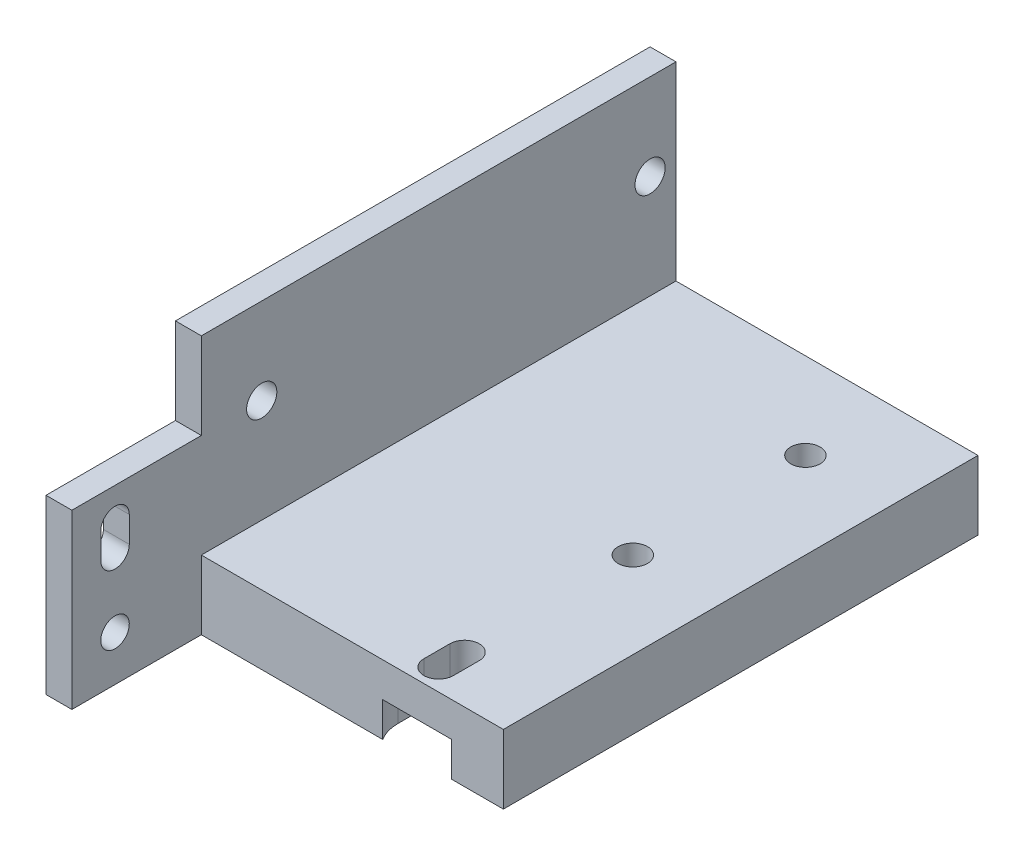
ISO-10303-21;
HEADER;
FILE_DESCRIPTION(('STEP AP214'),'2;1');
FILE_NAME('part.step','',(''),(''),'','','');
FILE_SCHEMA(('AUTOMOTIVE_DESIGN { 1 0 10303 214 1 1 1 1 }'));
ENDSEC;
DATA;
#1=APPLICATION_CONTEXT('core data for automotive mechanical design processes');
#2=APPLICATION_PROTOCOL_DEFINITION('international standard','automotive_design',2000,#1);
#3=PRODUCT_CONTEXT('',#1,'mechanical');
#4=PRODUCT('Part','Part','',(#3));
#5=PRODUCT_RELATED_PRODUCT_CATEGORY('part','',(#4));
#6=PRODUCT_DEFINITION_FORMATION('','',#4);
#7=PRODUCT_DEFINITION_CONTEXT('part definition',#1,'design');
#8=PRODUCT_DEFINITION('design','',#6,#7);
#9=PRODUCT_DEFINITION_SHAPE('','',#8);
#10=(LENGTH_UNIT() NAMED_UNIT(*) SI_UNIT(.MILLI.,.METRE.));
#11=(NAMED_UNIT(*) PLANE_ANGLE_UNIT() SI_UNIT($,.RADIAN.));
#12=(NAMED_UNIT(*) SI_UNIT($,.STERADIAN.) SOLID_ANGLE_UNIT());
#13=UNCERTAINTY_MEASURE_WITH_UNIT(LENGTH_MEASURE(1.E-05),#10,'distance_accuracy_value','');
#14=(GEOMETRIC_REPRESENTATION_CONTEXT(3) GLOBAL_UNCERTAINTY_ASSIGNED_CONTEXT((#13)) GLOBAL_UNIT_ASSIGNED_CONTEXT((#10,
#11,#12)) REPRESENTATION_CONTEXT('',''));
#15=CARTESIAN_POINT('',(0.,0.,0.));
#16=DIRECTION('',(0.,0.,1.));
#17=DIRECTION('',(1.,0.,0.));
#18=AXIS2_PLACEMENT_3D('',#15,#16,#17);
#19=CARTESIAN_POINT('',(0.,0.,55.));
#20=DIRECTION('',(0.,0.,1.));
#21=DIRECTION('',(1.,0.,0.));
#22=AXIS2_PLACEMENT_3D('',#19,#20,#21);
#23=PLANE('',#22);
#24=DIRECTION('',(0.,1.,0.));
#25=VECTOR('',#24,1.);
#26=CARTESIAN_POINT('',(3.,20.,55.));
#27=LINE('',#26,#25);
#28=CARTESIAN_POINT('',(3.,0.,55.));
#29=VERTEX_POINT('',#28);
#30=CARTESIAN_POINT('',(3.,7.99999999999999,55.));
#31=VERTEX_POINT('',#30);
#32=EDGE_CURVE('E50',#29,#31,#27,.T.);
#33=ORIENTED_EDGE('',*,*,#32,.F.);
#34=DIRECTION('',(1.,0.,0.));
#35=VECTOR('',#34,1.);
#36=CARTESIAN_POINT('',(0.,0.,55.));
#37=LINE('',#36,#35);
#38=CARTESIAN_POINT('',(24.0200502515735,0.,55.));
#39=VERTEX_POINT('',#38);
#40=EDGE_CURVE('E377',#29,#39,#37,.T.);
#41=ORIENTED_EDGE('',*,*,#40,.T.);
#42=DIRECTION('',(0.,-1.,0.));
#43=VECTOR('',#42,1.);
#44=CARTESIAN_POINT('',(24.0200502515735,4.,55.));
#45=LINE('',#44,#43);
#46=CARTESIAN_POINT('',(24.0200502515735,4.,55.));
#47=VERTEX_POINT('',#46);
#48=EDGE_CURVE('E11',#47,#39,#45,.T.);
#49=ORIENTED_EDGE('',*,*,#48,.F.);
#50=DIRECTION('',(1.,0.,0.));
#51=VECTOR('',#50,1.);
#52=CARTESIAN_POINT('',(0.,4.,55.));
#53=LINE('',#52,#51);
#54=CARTESIAN_POINT('',(31.9799497484265,4.,55.));
#55=VERTEX_POINT('',#54);
#56=EDGE_CURVE('E320',#47,#55,#53,.T.);
#57=ORIENTED_EDGE('',*,*,#56,.T.);
#58=DIRECTION('',(0.,-1.,0.));
#59=VECTOR('',#58,1.);
#60=CARTESIAN_POINT('',(31.9799497484265,4.,55.));
#61=LINE('',#60,#59);
#62=CARTESIAN_POINT('',(31.9799497484265,0.,55.));
#63=VERTEX_POINT('',#62);
#64=EDGE_CURVE('E42',#63,#55,#61,.F.);
#65=ORIENTED_EDGE('',*,*,#64,.F.);
#66=CARTESIAN_POINT('',(38.,0.,55.));
#67=VERTEX_POINT('',#66);
#68=EDGE_CURVE('E375',#63,#67,#37,.T.);
#69=ORIENTED_EDGE('',*,*,#68,.T.);
#70=DIRECTION('',(0.,1.,0.));
#71=VECTOR('',#70,1.);
#72=CARTESIAN_POINT('',(38.,0.,55.));
#73=LINE('',#72,#71);
#74=CARTESIAN_POINT('',(38.,8.,55.));
#75=VERTEX_POINT('',#74);
#76=EDGE_CURVE('E379',#67,#75,#73,.T.);
#77=ORIENTED_EDGE('',*,*,#76,.T.);
#78=DIRECTION('',(-1.,0.,0.));
#79=VECTOR('',#78,1.);
#80=CARTESIAN_POINT('',(38.,8.,55.));
#81=LINE('',#80,#79);
#82=EDGE_CURVE('E381',#75,#31,#81,.T.);
#83=ORIENTED_EDGE('',*,*,#82,.T.);
#84=EDGE_LOOP('',(#33,#41,#49,#57,#65,#69,#77,#83));
#85=FACE_BOUND('',#84,.T.);
#86=ADVANCED_FACE('F33',(#85),#23,.T.);
#87=CARTESIAN_POINT('',(28.,30.,10.));
#88=DIRECTION('',(0.,-1.,0.));
#89=DIRECTION('',(0.,0.,-1.));
#90=AXIS2_PLACEMENT_3D('',#87,#88,#89);
#91=CYLINDRICAL_SURFACE('',#90,1.7);
#92=CARTESIAN_POINT('',(28.,8.,10.));
#93=DIRECTION('',(0.,-1.,0.));
#94=DIRECTION('',(1.,0.,0.));
#95=AXIS2_PLACEMENT_3D('',#92,#93,#94);
#96=CIRCLE('',#95,1.7);
#97=CARTESIAN_POINT('',(29.7,8.,10.));
#98=VERTEX_POINT('',#97);
#99=EDGE_CURVE('E327',#98,#98,#96,.T.);
#100=ORIENTED_EDGE('',*,*,#99,.F.);
#101=EDGE_LOOP('',(#100));
#102=FACE_BOUND('',#101,.T.);
#103=CARTESIAN_POINT('',(28.,4.,10.));
#104=DIRECTION('',(0.,-1.,0.));
#105=DIRECTION('',(0.,0.,-1.));
#106=AXIS2_PLACEMENT_3D('',#103,#104,#105);
#107=CIRCLE('',#106,1.7);
#108=CARTESIAN_POINT('',(28.,4.,8.3));
#109=VERTEX_POINT('',#108);
#110=EDGE_CURVE('E277',#109,#109,#107,.F.);
#111=ORIENTED_EDGE('',*,*,#110,.F.);
#112=EDGE_LOOP('',(#111));
#113=FACE_BOUND('',#112,.T.);
#114=ADVANCED_FACE('F461',(#102,#113),#91,.F.);
#115=CARTESIAN_POINT('',(28.,30.,52.5));
#116=DIRECTION('',(0.,-1.,0.));
#117=DIRECTION('',(0.,0.,-1.));
#118=AXIS2_PLACEMENT_3D('',#115,#116,#117);
#119=CYLINDRICAL_SURFACE('',#118,1.70000000000001);
#120=CARTESIAN_POINT('',(28.,4.,52.5));
#121=DIRECTION('',(0.,-1.,0.));
#122=DIRECTION('',(0.,0.,-1.));
#123=AXIS2_PLACEMENT_3D('',#120,#121,#122);
#124=CIRCLE('',#123,1.70000000000001);
#125=CARTESIAN_POINT('',(26.3,4.,52.5));
#126=VERTEX_POINT('',#125);
#127=CARTESIAN_POINT('',(29.7,4.,52.5));
#128=VERTEX_POINT('',#127);
#129=EDGE_CURVE('E318',#126,#128,#124,.F.);
#130=ORIENTED_EDGE('',*,*,#129,.F.);
#131=DIRECTION('',(0.,-1.,0.));
#132=VECTOR('',#131,1.);
#133=CARTESIAN_POINT('',(26.3,30.,52.5));
#134=LINE('',#133,#132);
#135=CARTESIAN_POINT('',(26.3,7.99999999999999,52.5));
#136=VERTEX_POINT('',#135);
#137=EDGE_CURVE('E323',#136,#126,#134,.T.);
#138=ORIENTED_EDGE('',*,*,#137,.F.);
#139=CARTESIAN_POINT('',(28.,8.,52.5));
#140=DIRECTION('',(0.,-1.,0.));
#141=DIRECTION('',(1.,0.,0.));
#142=AXIS2_PLACEMENT_3D('',#139,#140,#141);
#143=CIRCLE('',#142,1.70000000000001);
#144=CARTESIAN_POINT('',(29.7,8.,52.5));
#145=VERTEX_POINT('',#144);
#146=EDGE_CURVE('E427',#145,#136,#143,.T.);
#147=ORIENTED_EDGE('',*,*,#146,.F.);
#148=DIRECTION('',(0.,-1.,0.));
#149=VECTOR('',#148,1.);
#150=CARTESIAN_POINT('',(29.7,30.,52.5));
#151=LINE('',#150,#149);
#152=EDGE_CURVE('E324',#145,#128,#151,.T.);
#153=ORIENTED_EDGE('',*,*,#152,.T.);
#154=EDGE_LOOP('',(#130,#138,#147,#153));
#155=FACE_BOUND('',#154,.T.);
#156=ADVANCED_FACE('F467',(#155),#119,.F.);
#157=CARTESIAN_POINT('',(29.7,30.,52.5));
#158=DIRECTION('',(1.,0.,0.));
#159=DIRECTION('',(0.,0.,-1.));
#160=AXIS2_PLACEMENT_3D('',#157,#158,#159);
#161=PLANE('',#160);
#162=DIRECTION('',(0.,0.,-1.));
#163=VECTOR('',#162,1.);
#164=CARTESIAN_POINT('',(29.7,4.,52.5));
#165=LINE('',#164,#163);
#166=CARTESIAN_POINT('',(29.7,4.,49.5));
#167=VERTEX_POINT('',#166);
#168=EDGE_CURVE('E316',#128,#167,#165,.T.);
#169=ORIENTED_EDGE('',*,*,#168,.F.);
#170=ORIENTED_EDGE('',*,*,#152,.F.);
#171=DIRECTION('',(0.,0.,1.));
#172=VECTOR('',#171,1.);
#173=CARTESIAN_POINT('',(29.7,8.,55.));
#174=LINE('',#173,#172);
#175=CARTESIAN_POINT('',(29.7,8.,49.5));
#176=VERTEX_POINT('',#175);
#177=EDGE_CURVE('E424',#176,#145,#174,.T.);
#178=ORIENTED_EDGE('',*,*,#177,.F.);
#179=DIRECTION('',(0.,-1.,0.));
#180=VECTOR('',#179,1.);
#181=CARTESIAN_POINT('',(29.7,30.,49.5));
#182=LINE('',#181,#180);
#183=EDGE_CURVE('E328',#176,#167,#182,.T.);
#184=ORIENTED_EDGE('',*,*,#183,.T.);
#185=EDGE_LOOP('',(#169,#170,#178,#184));
#186=FACE_BOUND('',#185,.T.);
#187=ADVANCED_FACE('F614',(#186),#161,.F.);
#188=CARTESIAN_POINT('',(28.,30.,49.5));
#189=DIRECTION('',(0.,-1.,0.));
#190=DIRECTION('',(0.,0.,-1.));
#191=AXIS2_PLACEMENT_3D('',#188,#189,#190);
#192=CYLINDRICAL_SURFACE('',#191,1.70000000000001);
#193=CARTESIAN_POINT('',(28.,4.,49.5));
#194=DIRECTION('',(0.,-1.,0.));
#195=DIRECTION('',(0.,0.,-1.));
#196=AXIS2_PLACEMENT_3D('',#193,#194,#195);
#197=CIRCLE('',#196,1.70000000000001);
#198=CARTESIAN_POINT('',(26.3,4.,49.5));
#199=VERTEX_POINT('',#198);
#200=EDGE_CURVE('E308',#167,#199,#197,.F.);
#201=ORIENTED_EDGE('',*,*,#200,.F.);
#202=ORIENTED_EDGE('',*,*,#183,.F.);
#203=CARTESIAN_POINT('',(28.,8.,49.5));
#204=DIRECTION('',(0.,-1.,0.));
#205=DIRECTION('',(1.,0.,0.));
#206=AXIS2_PLACEMENT_3D('',#203,#204,#205);
#207=CIRCLE('',#206,1.70000000000001);
#208=CARTESIAN_POINT('',(26.3,7.99999999999999,49.5));
#209=VERTEX_POINT('',#208);
#210=EDGE_CURVE('E421',#209,#176,#207,.T.);
#211=ORIENTED_EDGE('',*,*,#210,.F.);
#212=DIRECTION('',(0.,-1.,0.));
#213=VECTOR('',#212,1.);
#214=CARTESIAN_POINT('',(26.3,30.,49.5));
#215=LINE('',#214,#213);
#216=EDGE_CURVE('E331',#209,#199,#215,.T.);
#217=ORIENTED_EDGE('',*,*,#216,.T.);
#218=EDGE_LOOP('',(#201,#202,#211,#217));
#219=FACE_BOUND('',#218,.T.);
#220=ADVANCED_FACE('F620',(#219),#192,.F.);
#221=CARTESIAN_POINT('',(26.3,30.,52.5));
#222=DIRECTION('',(-1.,0.,0.));
#223=DIRECTION('',(0.,0.,1.));
#224=AXIS2_PLACEMENT_3D('',#221,#222,#223);
#225=PLANE('',#224);
#226=DIRECTION('',(0.,0.,1.));
#227=VECTOR('',#226,1.);
#228=CARTESIAN_POINT('',(26.3,4.,52.5));
#229=LINE('',#228,#227);
#230=EDGE_CURVE('E430',#199,#126,#229,.T.);
#231=ORIENTED_EDGE('',*,*,#230,.F.);
#232=ORIENTED_EDGE('',*,*,#216,.F.);
#233=DIRECTION('',(0.,0.,-1.));
#234=VECTOR('',#233,1.);
#235=CARTESIAN_POINT('',(26.3,7.99999999999999,55.));
#236=LINE('',#235,#234);
#237=EDGE_CURVE('E416',#136,#209,#236,.T.);
#238=ORIENTED_EDGE('',*,*,#237,.F.);
#239=ORIENTED_EDGE('',*,*,#137,.T.);
#240=EDGE_LOOP('',(#231,#232,#238,#239));
#241=FACE_BOUND('',#240,.T.);
#242=ADVANCED_FACE('F502',(#241),#225,.F.);
#243=CARTESIAN_POINT('',(0.,30.,55.));
#244=DIRECTION('',(1.,0.,0.));
#245=DIRECTION('',(0.,1.,0.));
#246=AXIS2_PLACEMENT_3D('',#243,#244,#245);
#247=PLANE('',#246);
#248=CARTESIAN_POINT('',(0.,20.,3.));
#249=DIRECTION('',(-1.,0.,0.));
#250=DIRECTION('',(0.,-1.,0.));
#251=AXIS2_PLACEMENT_3D('',#248,#249,#250);
#252=CIRCLE('',#251,1.75);
#253=CARTESIAN_POINT('',(0.,18.25,3.));
#254=VERTEX_POINT('',#253);
#255=EDGE_CURVE('E266',#254,#254,#252,.T.);
#256=ORIENTED_EDGE('',*,*,#255,.F.);
#257=EDGE_LOOP('',(#256));
#258=FACE_BOUND('',#257,.T.);
#259=CARTESIAN_POINT('',(0.,20.,48.));
#260=DIRECTION('',(-1.,0.,0.));
#261=DIRECTION('',(0.,-1.,0.));
#262=AXIS2_PLACEMENT_3D('',#259,#260,#261);
#263=CIRCLE('',#262,1.75);
#264=CARTESIAN_POINT('',(0.,18.25,48.));
#265=VERTEX_POINT('',#264);
#266=EDGE_CURVE('E270',#265,#265,#263,.T.);
#267=ORIENTED_EDGE('',*,*,#266,.F.);
#268=EDGE_LOOP('',(#267));
#269=FACE_BOUND('',#268,.T.);
#270=DIRECTION('',(0.,-1.,0.));
#271=VECTOR('',#270,1.);
#272=CARTESIAN_POINT('',(0.,30.,0.));
#273=LINE('',#272,#271);
#274=CARTESIAN_POINT('',(0.,30.,0.));
#275=VERTEX_POINT('',#274);
#276=CARTESIAN_POINT('',(0.,0.,0.));
#277=VERTEX_POINT('',#276);
#278=EDGE_CURVE('E366',#275,#277,#273,.T.);
#279=ORIENTED_EDGE('',*,*,#278,.T.);
#280=DIRECTION('',(0.,0.,-1.));
#281=VECTOR('',#280,1.);
#282=CARTESIAN_POINT('',(0.,0.,55.));
#283=LINE('',#282,#281);
#284=CARTESIAN_POINT('',(0.,0.,70.));
#285=VERTEX_POINT('',#284);
#286=EDGE_CURVE('E413',#285,#277,#283,.T.);
#287=ORIENTED_EDGE('',*,*,#286,.F.);
#288=DIRECTION('',(0.,1.,0.));
#289=VECTOR('',#288,1.);
#290=CARTESIAN_POINT('',(0.,0.,70.));
#291=LINE('',#290,#289);
#292=CARTESIAN_POINT('',(0.,20.,70.));
#293=VERTEX_POINT('',#292);
#294=EDGE_CURVE('E251',#285,#293,#291,.T.);
#295=ORIENTED_EDGE('',*,*,#294,.T.);
#296=DIRECTION('',(0.,0.,-1.));
#297=VECTOR('',#296,1.);
#298=CARTESIAN_POINT('',(0.,20.,70.));
#299=LINE('',#298,#297);
#300=CARTESIAN_POINT('',(0.,20.,55.));
#301=VERTEX_POINT('',#300);
#302=EDGE_CURVE('E254',#293,#301,#299,.T.);
#303=ORIENTED_EDGE('',*,*,#302,.T.);
#304=DIRECTION('',(0.,-1.,0.));
#305=VECTOR('',#304,1.);
#306=CARTESIAN_POINT('',(0.,30.,55.));
#307=LINE('',#306,#305);
#308=CARTESIAN_POINT('',(0.,30.,55.));
#309=VERTEX_POINT('',#308);
#310=EDGE_CURVE('E373',#309,#301,#307,.T.);
#311=ORIENTED_EDGE('',*,*,#310,.F.);
#312=DIRECTION('',(0.,0.,-1.));
#313=VECTOR('',#312,1.);
#314=CARTESIAN_POINT('',(0.,30.,55.));
#315=LINE('',#314,#313);
#316=EDGE_CURVE('E387',#309,#275,#315,.T.);
#317=ORIENTED_EDGE('',*,*,#316,.T.);
#318=EDGE_LOOP('',(#279,#287,#295,#303,#311,#317));
#319=FACE_BOUND('',#318,.T.);
#320=CARTESIAN_POINT('',(0.,13.25,65.));
#321=DIRECTION('',(-1.,0.,0.));
#322=DIRECTION('',(0.,-1.,0.));
#323=AXIS2_PLACEMENT_3D('',#320,#321,#322);
#324=CIRCLE('',#323,1.65);
#325=CARTESIAN_POINT('',(0.,13.25,63.35));
#326=VERTEX_POINT('',#325);
#327=CARTESIAN_POINT('',(0.,13.25,66.65));
#328=VERTEX_POINT('',#327);
#329=EDGE_CURVE('E235',#326,#328,#324,.T.);
#330=ORIENTED_EDGE('',*,*,#329,.F.);
#331=DIRECTION('',(0.,-1.,0.));
#332=VECTOR('',#331,1.);
#333=CARTESIAN_POINT('',(0.,13.25,63.35));
#334=LINE('',#333,#332);
#335=CARTESIAN_POINT('',(0.,16.25,63.35));
#336=VERTEX_POINT('',#335);
#337=EDGE_CURVE('E239',#336,#326,#334,.T.);
#338=ORIENTED_EDGE('',*,*,#337,.F.);
#339=CARTESIAN_POINT('',(0.,16.25,65.));
#340=DIRECTION('',(-1.,0.,0.));
#341=DIRECTION('',(0.,-1.,0.));
#342=AXIS2_PLACEMENT_3D('',#339,#340,#341);
#343=CIRCLE('',#342,1.65);
#344=CARTESIAN_POINT('',(0.,16.25,66.65));
#345=VERTEX_POINT('',#344);
#346=EDGE_CURVE('E220',#345,#336,#343,.T.);
#347=ORIENTED_EDGE('',*,*,#346,.F.);
#348=DIRECTION('',(0.,1.,0.));
#349=VECTOR('',#348,1.);
#350=CARTESIAN_POINT('',(0.,13.25,66.65));
#351=LINE('',#350,#349);
#352=EDGE_CURVE('E229',#328,#345,#351,.T.);
#353=ORIENTED_EDGE('',*,*,#352,.F.);
#354=EDGE_LOOP('',(#330,#338,#347,#353));
#355=FACE_BOUND('',#354,.T.);
#356=CARTESIAN_POINT('',(0.,5.25,65.));
#357=DIRECTION('',(-1.,0.,0.));
#358=DIRECTION('',(0.,-1.,0.));
#359=AXIS2_PLACEMENT_3D('',#356,#357,#358);
#360=CIRCLE('',#359,1.65);
#361=CARTESIAN_POINT('',(0.,3.6,65.));
#362=VERTEX_POINT('',#361);
#363=EDGE_CURVE('E246',#362,#362,#360,.T.);
#364=ORIENTED_EDGE('',*,*,#363,.F.);
#365=EDGE_LOOP('',(#364));
#366=FACE_BOUND('',#365,.T.);
#367=ADVANCED_FACE('F35',(#258,#269,#319,#355,#366),#247,.F.);
#368=CARTESIAN_POINT('',(0.,0.,55.));
#369=DIRECTION('',(0.,1.,0.));
#370=DIRECTION('',(0.,0.,1.));
#371=AXIS2_PLACEMENT_3D('',#368,#369,#370);
#372=PLANE('',#371);
#373=CARTESIAN_POINT('',(28.,0.,10.));
#374=DIRECTION('',(0.,-1.,0.));
#375=DIRECTION('',(0.,0.,-1.));
#376=AXIS2_PLACEMENT_3D('',#373,#374,#375);
#377=CIRCLE('',#376,4.7);
#378=CARTESIAN_POINT('',(28.,0.,5.3));
#379=VERTEX_POINT('',#378);
#380=EDGE_CURVE('E278',#379,#379,#377,.T.);
#381=ORIENTED_EDGE('',*,*,#380,.F.);
#382=EDGE_LOOP('',(#381));
#383=FACE_BOUND('',#382,.T.);
#384=DIRECTION('',(-1.,0.,0.));
#385=VECTOR('',#384,1.);
#386=CARTESIAN_POINT('',(20.4,0.,42.6));
#387=LINE('',#386,#385);
#388=CARTESIAN_POINT('',(35.6,0.,42.6));
#389=VERTEX_POINT('',#388);
#390=CARTESIAN_POINT('',(20.4,0.,42.6));
#391=VERTEX_POINT('',#390);
#392=EDGE_CURVE('E356',#389,#391,#387,.T.);
#393=ORIENTED_EDGE('',*,*,#392,.F.);
#394=DIRECTION('',(0.,0.,1.));
#395=VECTOR('',#394,1.);
#396=CARTESIAN_POINT('',(35.6,0.,42.6));
#397=LINE('',#396,#395);
#398=CARTESIAN_POINT('',(35.6,0.,17.4));
#399=VERTEX_POINT('',#398);
#400=EDGE_CURVE('E339',#399,#389,#397,.T.);
#401=ORIENTED_EDGE('',*,*,#400,.F.);
#402=DIRECTION('',(1.,0.,0.));
#403=VECTOR('',#402,1.);
#404=CARTESIAN_POINT('',(20.4,0.,17.4));
#405=LINE('',#404,#403);
#406=CARTESIAN_POINT('',(20.4,0.,17.4));
#407=VERTEX_POINT('',#406);
#408=EDGE_CURVE('E345',#407,#399,#405,.T.);
#409=ORIENTED_EDGE('',*,*,#408,.F.);
#410=DIRECTION('',(0.,0.,-1.));
#411=VECTOR('',#410,1.);
#412=CARTESIAN_POINT('',(20.4,0.,42.6));
#413=LINE('',#412,#411);
#414=EDGE_CURVE('E359',#391,#407,#413,.T.);
#415=ORIENTED_EDGE('',*,*,#414,.F.);
#416=EDGE_LOOP('',(#393,#401,#409,#415));
#417=FACE_BOUND('',#416,.T.);
#418=DIRECTION('',(0.,0.,-1.));
#419=VECTOR('',#418,1.);
#420=CARTESIAN_POINT('',(23.3,0.,52.5));
#421=LINE('',#420,#419);
#422=CARTESIAN_POINT('',(23.3,0.,52.5));
#423=VERTEX_POINT('',#422);
#424=CARTESIAN_POINT('',(23.3,0.,49.5));
#425=VERTEX_POINT('',#424);
#426=EDGE_CURVE('E296',#423,#425,#421,.T.);
#427=ORIENTED_EDGE('',*,*,#426,.F.);
#428=CARTESIAN_POINT('',(28.,0.,52.5));
#429=DIRECTION('',(0.,-1.,0.));
#430=DIRECTION('',(0.,0.,-1.));
#431=AXIS2_PLACEMENT_3D('',#428,#429,#430);
#432=CIRCLE('',#431,4.7);
#433=EDGE_CURVE('E297',#39,#423,#432,.T.);
#434=ORIENTED_EDGE('',*,*,#433,.F.);
#435=ORIENTED_EDGE('',*,*,#40,.F.);
#436=DIRECTION('',(0.,0.,-1.));
#437=VECTOR('',#436,1.);
#438=CARTESIAN_POINT('',(3.,0.,55.));
#439=LINE('',#438,#437);
#440=CARTESIAN_POINT('',(3.,0.,70.));
#441=VERTEX_POINT('',#440);
#442=EDGE_CURVE('E526',#441,#29,#439,.T.);
#443=ORIENTED_EDGE('',*,*,#442,.F.);
#444=DIRECTION('',(-1.,0.,0.));
#445=VECTOR('',#444,1.);
#446=CARTESIAN_POINT('',(28.,0.,70.));
#447=LINE('',#446,#445);
#448=EDGE_CURVE('E257',#441,#285,#447,.T.);
#449=ORIENTED_EDGE('',*,*,#448,.T.);
#450=ORIENTED_EDGE('',*,*,#286,.T.);
#451=DIRECTION('',(1.,0.,0.));
#452=VECTOR('',#451,1.);
#453=CARTESIAN_POINT('',(0.,0.,0.));
#454=LINE('',#453,#452);
#455=CARTESIAN_POINT('',(38.,0.,0.));
#456=VERTEX_POINT('',#455);
#457=EDGE_CURVE('E390',#277,#456,#454,.T.);
#458=ORIENTED_EDGE('',*,*,#457,.T.);
#459=DIRECTION('',(0.,0.,-1.));
#460=VECTOR('',#459,1.);
#461=CARTESIAN_POINT('',(38.,0.,55.));
#462=LINE('',#461,#460);
#463=EDGE_CURVE('E410',#67,#456,#462,.T.);
#464=ORIENTED_EDGE('',*,*,#463,.F.);
#465=ORIENTED_EDGE('',*,*,#68,.F.);
#466=CARTESIAN_POINT('',(32.7,0.,52.5));
#467=VERTEX_POINT('',#466);
#468=EDGE_CURVE('E294',#467,#63,#432,.T.);
#469=ORIENTED_EDGE('',*,*,#468,.F.);
#470=DIRECTION('',(0.,0.,1.));
#471=VECTOR('',#470,1.);
#472=CARTESIAN_POINT('',(32.7,0.,49.5));
#473=LINE('',#472,#471);
#474=CARTESIAN_POINT('',(32.7,0.,49.5));
#475=VERTEX_POINT('',#474);
#476=EDGE_CURVE('E303',#475,#467,#473,.T.);
#477=ORIENTED_EDGE('',*,*,#476,.F.);
#478=CARTESIAN_POINT('',(28.,0.,49.5));
#479=DIRECTION('',(0.,-1.,0.));
#480=DIRECTION('',(0.,0.,-1.));
#481=AXIS2_PLACEMENT_3D('',#478,#479,#480);
#482=CIRCLE('',#481,4.7);
#483=EDGE_CURVE('E300',#425,#475,#482,.T.);
#484=ORIENTED_EDGE('',*,*,#483,.F.);
#485=EDGE_LOOP('',(#427,#434,#435,#443,#449,#450,#458,#464,#465,#469,#477,#484));
#486=FACE_BOUND('',#485,.T.);
#487=ADVANCED_FACE('F495',(#383,#417,#486),#372,.F.);
#488=CARTESIAN_POINT('',(38.,0.,55.));
#489=DIRECTION('',(-1.,0.,0.));
#490=DIRECTION('',(0.,0.,1.));
#491=AXIS2_PLACEMENT_3D('',#488,#489,#490);
#492=PLANE('',#491);
#493=DIRECTION('',(0.,1.,0.));
#494=VECTOR('',#493,1.);
#495=CARTESIAN_POINT('',(38.,0.,0.));
#496=LINE('',#495,#494);
#497=CARTESIAN_POINT('',(38.,8.,0.));
#498=VERTEX_POINT('',#497);
#499=EDGE_CURVE('E392',#456,#498,#496,.T.);
#500=ORIENTED_EDGE('',*,*,#499,.T.);
#501=DIRECTION('',(0.,0.,-1.));
#502=VECTOR('',#501,1.);
#503=CARTESIAN_POINT('',(38.,8.,55.));
#504=LINE('',#503,#502);
#505=EDGE_CURVE('E407',#75,#498,#504,.T.);
#506=ORIENTED_EDGE('',*,*,#505,.F.);
#507=ORIENTED_EDGE('',*,*,#76,.F.);
#508=ORIENTED_EDGE('',*,*,#463,.T.);
#509=EDGE_LOOP('',(#500,#506,#507,#508));
#510=FACE_BOUND('',#509,.T.);
#511=ADVANCED_FACE('F492',(#510),#492,.F.);
#512=CARTESIAN_POINT('',(38.,8.,55.));
#513=DIRECTION('',(0.,-1.,0.));
#514=DIRECTION('',(1.,0.,0.));
#515=AXIS2_PLACEMENT_3D('',#512,#513,#514);
#516=PLANE('',#515);
#517=ORIENTED_EDGE('',*,*,#99,.T.);
#518=EDGE_LOOP('',(#517));
#519=FACE_BOUND('',#518,.T.);
#520=ORIENTED_EDGE('',*,*,#177,.T.);
#521=ORIENTED_EDGE('',*,*,#146,.T.);
#522=ORIENTED_EDGE('',*,*,#237,.T.);
#523=ORIENTED_EDGE('',*,*,#210,.T.);
#524=EDGE_LOOP('',(#520,#521,#522,#523));
#525=FACE_BOUND('',#524,.T.);
#526=CARTESIAN_POINT('',(28.,8.,30.));
#527=DIRECTION('',(0.,-1.,0.));
#528=DIRECTION('',(1.,0.,0.));
#529=AXIS2_PLACEMENT_3D('',#526,#527,#528);
#530=CIRCLE('',#529,1.7);
#531=CARTESIAN_POINT('',(29.7,8.,30.));
#532=VERTEX_POINT('',#531);
#533=EDGE_CURVE('E336',#532,#532,#530,.T.);
#534=ORIENTED_EDGE('',*,*,#533,.T.);
#535=EDGE_LOOP('',(#534));
#536=FACE_BOUND('',#535,.T.);
#537=DIRECTION('',(-1.,0.,0.));
#538=VECTOR('',#537,1.);
#539=CARTESIAN_POINT('',(38.,8.,0.));
#540=LINE('',#539,#538);
#541=CARTESIAN_POINT('',(3.,7.99999999999999,0.));
#542=VERTEX_POINT('',#541);
#543=EDGE_CURVE('E394',#498,#542,#540,.T.);
#544=ORIENTED_EDGE('',*,*,#543,.T.);
#545=DIRECTION('',(0.,0.,-1.));
#546=VECTOR('',#545,1.);
#547=CARTESIAN_POINT('',(3.,7.99999999999999,55.));
#548=LINE('',#547,#546);
#549=EDGE_CURVE('E404',#31,#542,#548,.T.);
#550=ORIENTED_EDGE('',*,*,#549,.F.);
#551=ORIENTED_EDGE('',*,*,#82,.F.);
#552=ORIENTED_EDGE('',*,*,#505,.T.);
#553=EDGE_LOOP('',(#544,#550,#551,#552));
#554=FACE_BOUND('',#553,.T.);
#555=ADVANCED_FACE('F486',(#519,#525,#536,#554),#516,.F.);
#556=CARTESIAN_POINT('',(3.,7.99999999999999,55.));
#557=DIRECTION('',(-1.,0.,0.));
#558=DIRECTION('',(0.,0.,1.));
#559=AXIS2_PLACEMENT_3D('',#556,#557,#558);
#560=PLANE('',#559);
#561=CARTESIAN_POINT('',(3.,20.,3.));
#562=DIRECTION('',(-1.,0.,0.));
#563=DIRECTION('',(0.,0.,1.));
#564=AXIS2_PLACEMENT_3D('',#561,#562,#563);
#565=CIRCLE('',#564,1.75);
#566=CARTESIAN_POINT('',(3.,20.,4.75));
#567=VERTEX_POINT('',#566);
#568=EDGE_CURVE('E37',#567,#567,#565,.T.);
#569=ORIENTED_EDGE('',*,*,#568,.T.);
#570=EDGE_LOOP('',(#569));
#571=FACE_BOUND('',#570,.T.);
#572=CARTESIAN_POINT('',(3.,20.,48.));
#573=DIRECTION('',(-1.,0.,0.));
#574=DIRECTION('',(0.,0.,1.));
#575=AXIS2_PLACEMENT_3D('',#572,#573,#574);
#576=CIRCLE('',#575,1.75);
#577=CARTESIAN_POINT('',(3.,20.,49.75));
#578=VERTEX_POINT('',#577);
#579=EDGE_CURVE('E273',#578,#578,#576,.T.);
#580=ORIENTED_EDGE('',*,*,#579,.T.);
#581=EDGE_LOOP('',(#580));
#582=FACE_BOUND('',#581,.T.);
#583=DIRECTION('',(0.,1.,0.));
#584=VECTOR('',#583,1.);
#585=CARTESIAN_POINT('',(3.,7.99999999999999,0.));
#586=LINE('',#585,#584);
#587=CARTESIAN_POINT('',(3.,30.,0.));
#588=VERTEX_POINT('',#587);
#589=EDGE_CURVE('E396',#542,#588,#586,.T.);
#590=ORIENTED_EDGE('',*,*,#589,.T.);
#591=DIRECTION('',(0.,0.,-1.));
#592=VECTOR('',#591,1.);
#593=CARTESIAN_POINT('',(3.,30.,55.));
#594=LINE('',#593,#592);
#595=CARTESIAN_POINT('',(3.,30.,55.));
#596=VERTEX_POINT('',#595);
#597=EDGE_CURVE('E401',#596,#588,#594,.T.);
#598=ORIENTED_EDGE('',*,*,#597,.F.);
#599=DIRECTION('',(0.,1.,0.));
#600=VECTOR('',#599,1.);
#601=CARTESIAN_POINT('',(3.,7.99999999999999,55.));
#602=LINE('',#601,#600);
#603=CARTESIAN_POINT('',(3.,20.,55.));
#604=VERTEX_POINT('',#603);
#605=EDGE_CURVE('E383',#604,#596,#602,.T.);
#606=ORIENTED_EDGE('',*,*,#605,.F.);
#607=DIRECTION('',(0.,0.,1.));
#608=VECTOR('',#607,1.);
#609=CARTESIAN_POINT('',(3.,20.,70.));
#610=LINE('',#609,#608);
#611=CARTESIAN_POINT('',(3.,20.,70.));
#612=VERTEX_POINT('',#611);
#613=EDGE_CURVE('E538',#604,#612,#610,.T.);
#614=ORIENTED_EDGE('',*,*,#613,.T.);
#615=DIRECTION('',(0.,-1.,0.));
#616=VECTOR('',#615,1.);
#617=CARTESIAN_POINT('',(3.,0.,70.));
#618=LINE('',#617,#616);
#619=EDGE_CURVE('E265',#612,#441,#618,.T.);
#620=ORIENTED_EDGE('',*,*,#619,.T.);
#621=ORIENTED_EDGE('',*,*,#442,.T.);
#622=ORIENTED_EDGE('',*,*,#32,.T.);
#623=ORIENTED_EDGE('',*,*,#549,.T.);
#624=EDGE_LOOP('',(#590,#598,#606,#614,#620,#621,#622,#623));
#625=FACE_BOUND('',#624,.T.);
#626=DIRECTION('',(0.,-1.,0.));
#627=VECTOR('',#626,1.);
#628=CARTESIAN_POINT('',(3.,13.25,66.65));
#629=LINE('',#628,#627);
#630=CARTESIAN_POINT('',(3.,16.25,66.65));
#631=VERTEX_POINT('',#630);
#632=CARTESIAN_POINT('',(3.,13.25,66.65));
#633=VERTEX_POINT('',#632);
#634=EDGE_CURVE('E259',#631,#633,#629,.T.);
#635=ORIENTED_EDGE('',*,*,#634,.F.);
#636=CARTESIAN_POINT('',(3.,16.25,65.));
#637=DIRECTION('',(-1.,0.,0.));
#638=DIRECTION('',(0.,0.,1.));
#639=AXIS2_PLACEMENT_3D('',#636,#637,#638);
#640=CIRCLE('',#639,1.65);
#641=CARTESIAN_POINT('',(3.,16.25,63.35));
#642=VERTEX_POINT('',#641);
#643=EDGE_CURVE('E222',#642,#631,#640,.F.);
#644=ORIENTED_EDGE('',*,*,#643,.F.);
#645=DIRECTION('',(0.,1.,0.));
#646=VECTOR('',#645,1.);
#647=CARTESIAN_POINT('',(3.,13.25,63.35));
#648=LINE('',#647,#646);
#649=CARTESIAN_POINT('',(3.,13.25,63.35));
#650=VERTEX_POINT('',#649);
#651=EDGE_CURVE('E533',#650,#642,#648,.T.);
#652=ORIENTED_EDGE('',*,*,#651,.F.);
#653=CARTESIAN_POINT('',(3.,13.25,65.));
#654=DIRECTION('',(-1.,0.,0.));
#655=DIRECTION('',(0.,0.,1.));
#656=AXIS2_PLACEMENT_3D('',#653,#654,#655);
#657=CIRCLE('',#656,1.65);
#658=EDGE_CURVE('E540',#633,#650,#657,.F.);
#659=ORIENTED_EDGE('',*,*,#658,.F.);
#660=EDGE_LOOP('',(#635,#644,#652,#659));
#661=FACE_BOUND('',#660,.T.);
#662=CARTESIAN_POINT('',(3.,5.25,65.));
#663=DIRECTION('',(-1.,0.,0.));
#664=DIRECTION('',(0.,0.,1.));
#665=AXIS2_PLACEMENT_3D('',#662,#663,#664);
#666=CIRCLE('',#665,1.65);
#667=CARTESIAN_POINT('',(3.,5.25,66.65));
#668=VERTEX_POINT('',#667);
#669=EDGE_CURVE('E269',#668,#668,#666,.F.);
#670=ORIENTED_EDGE('',*,*,#669,.F.);
#671=EDGE_LOOP('',(#670));
#672=FACE_BOUND('',#671,.T.);
#673=ADVANCED_FACE('F440',(#571,#582,#625,#661,#672),#560,.F.);
#674=CARTESIAN_POINT('',(3.,30.,55.));
#675=DIRECTION('',(0.,-1.,0.));
#676=DIRECTION('',(0.,0.,-1.));
#677=AXIS2_PLACEMENT_3D('',#674,#675,#676);
#678=PLANE('',#677);
#679=DIRECTION('',(-1.,0.,0.));
#680=VECTOR('',#679,1.);
#681=CARTESIAN_POINT('',(3.,30.,0.));
#682=LINE('',#681,#680);
#683=EDGE_CURVE('E376',#588,#275,#682,.T.);
#684=ORIENTED_EDGE('',*,*,#683,.T.);
#685=ORIENTED_EDGE('',*,*,#316,.F.);
#686=DIRECTION('',(-1.,0.,0.));
#687=VECTOR('',#686,1.);
#688=CARTESIAN_POINT('',(3.,30.,55.));
#689=LINE('',#688,#687);
#690=EDGE_CURVE('E385',#596,#309,#689,.T.);
#691=ORIENTED_EDGE('',*,*,#690,.F.);
#692=ORIENTED_EDGE('',*,*,#597,.T.);
#693=EDGE_LOOP('',(#684,#685,#691,#692));
#694=FACE_BOUND('',#693,.T.);
#695=ADVANCED_FACE('F474',(#694),#678,.F.);
#696=DIRECTION('',(-1.,0.,0.));
#697=VECTOR('',#696,1.);
#698=CARTESIAN_POINT('',(28.,20.,55.));
#699=LINE('',#698,#697);
#700=EDGE_CURVE('E58',#604,#301,#699,.T.);
#701=ORIENTED_EDGE('',*,*,#700,.F.);
#702=ORIENTED_EDGE('',*,*,#605,.T.);
#703=ORIENTED_EDGE('',*,*,#690,.T.);
#704=ORIENTED_EDGE('',*,*,#310,.T.);
#705=EDGE_LOOP('',(#701,#702,#703,#704));
#706=FACE_BOUND('',#705,.T.);
#707=ADVANCED_FACE('F463',(#706),#23,.T.);
#708=CARTESIAN_POINT('',(0.,0.,0.));
#709=DIRECTION('',(0.,0.,1.));
#710=DIRECTION('',(1.,0.,0.));
#711=AXIS2_PLACEMENT_3D('',#708,#709,#710);
#712=PLANE('',#711);
#713=ORIENTED_EDGE('',*,*,#278,.F.);
#714=ORIENTED_EDGE('',*,*,#683,.F.);
#715=ORIENTED_EDGE('',*,*,#589,.F.);
#716=ORIENTED_EDGE('',*,*,#543,.F.);
#717=ORIENTED_EDGE('',*,*,#499,.F.);
#718=ORIENTED_EDGE('',*,*,#457,.F.);
#719=EDGE_LOOP('',(#713,#714,#715,#716,#717,#718));
#720=FACE_BOUND('',#719,.T.);
#721=ADVANCED_FACE('F473',(#720),#712,.F.);
#722=CARTESIAN_POINT('',(35.6,3.,42.6));
#723=DIRECTION('',(1.,0.,0.));
#724=DIRECTION('',(0.,0.,-1.));
#725=AXIS2_PLACEMENT_3D('',#722,#723,#724);
#726=PLANE('',#725);
#727=ORIENTED_EDGE('',*,*,#400,.T.);
#728=DIRECTION('',(0.,-1.,0.));
#729=VECTOR('',#728,1.);
#730=CARTESIAN_POINT('',(35.6,3.,42.6));
#731=LINE('',#730,#729);
#732=CARTESIAN_POINT('',(35.6,3.,42.6));
#733=VERTEX_POINT('',#732);
#734=EDGE_CURVE('E354',#733,#389,#731,.T.);
#735=ORIENTED_EDGE('',*,*,#734,.F.);
#736=DIRECTION('',(0.,0.,1.));
#737=VECTOR('',#736,1.);
#738=CARTESIAN_POINT('',(35.6,3.,42.6));
#739=LINE('',#738,#737);
#740=CARTESIAN_POINT('',(35.6,3.,17.4));
#741=VERTEX_POINT('',#740);
#742=EDGE_CURVE('E341',#741,#733,#739,.T.);
#743=ORIENTED_EDGE('',*,*,#742,.F.);
#744=DIRECTION('',(0.,-1.,0.));
#745=VECTOR('',#744,1.);
#746=CARTESIAN_POINT('',(35.6,3.,17.4));
#747=LINE('',#746,#745);
#748=EDGE_CURVE('E364',#741,#399,#747,.T.);
#749=ORIENTED_EDGE('',*,*,#748,.T.);
#750=EDGE_LOOP('',(#727,#735,#743,#749));
#751=FACE_BOUND('',#750,.T.);
#752=ADVANCED_FACE('F479',(#751),#726,.F.);
#753=CARTESIAN_POINT('',(20.4,3.,17.4));
#754=DIRECTION('',(0.,0.,-1.));
#755=DIRECTION('',(-1.,0.,0.));
#756=AXIS2_PLACEMENT_3D('',#753,#754,#755);
#757=PLANE('',#756);
#758=ORIENTED_EDGE('',*,*,#408,.T.);
#759=ORIENTED_EDGE('',*,*,#748,.F.);
#760=DIRECTION('',(1.,0.,0.));
#761=VECTOR('',#760,1.);
#762=CARTESIAN_POINT('',(20.4,3.,17.4));
#763=LINE('',#762,#761);
#764=CARTESIAN_POINT('',(20.4,3.,17.4));
#765=VERTEX_POINT('',#764);
#766=EDGE_CURVE('E351',#765,#741,#763,.T.);
#767=ORIENTED_EDGE('',*,*,#766,.F.);
#768=DIRECTION('',(0.,-1.,0.));
#769=VECTOR('',#768,1.);
#770=CARTESIAN_POINT('',(20.4,3.,17.4));
#771=LINE('',#770,#769);
#772=EDGE_CURVE('E367',#765,#407,#771,.T.);
#773=ORIENTED_EDGE('',*,*,#772,.T.);
#774=EDGE_LOOP('',(#758,#759,#767,#773));
#775=FACE_BOUND('',#774,.T.);
#776=ADVANCED_FACE('F641',(#775),#757,.F.);
#777=CARTESIAN_POINT('',(20.4,3.,42.6));
#778=DIRECTION('',(-1.,0.,0.));
#779=DIRECTION('',(0.,0.,1.));
#780=AXIS2_PLACEMENT_3D('',#777,#778,#779);
#781=PLANE('',#780);
#782=ORIENTED_EDGE('',*,*,#414,.T.);
#783=ORIENTED_EDGE('',*,*,#772,.F.);
#784=DIRECTION('',(0.,0.,-1.));
#785=VECTOR('',#784,1.);
#786=CARTESIAN_POINT('',(20.4,3.,42.6));
#787=LINE('',#786,#785);
#788=CARTESIAN_POINT('',(20.4,3.,42.6));
#789=VERTEX_POINT('',#788);
#790=EDGE_CURVE('E348',#789,#765,#787,.T.);
#791=ORIENTED_EDGE('',*,*,#790,.F.);
#792=DIRECTION('',(0.,-1.,0.));
#793=VECTOR('',#792,1.);
#794=CARTESIAN_POINT('',(20.4,3.,42.6));
#795=LINE('',#794,#793);
#796=EDGE_CURVE('E369',#789,#391,#795,.T.);
#797=ORIENTED_EDGE('',*,*,#796,.T.);
#798=EDGE_LOOP('',(#782,#783,#791,#797));
#799=FACE_BOUND('',#798,.T.);
#800=ADVANCED_FACE('F644',(#799),#781,.F.);
#801=CARTESIAN_POINT('',(20.4,3.,42.6));
#802=DIRECTION('',(0.,0.,1.));
#803=DIRECTION('',(1.,0.,0.));
#804=AXIS2_PLACEMENT_3D('',#801,#802,#803);
#805=PLANE('',#804);
#806=ORIENTED_EDGE('',*,*,#392,.T.);
#807=ORIENTED_EDGE('',*,*,#796,.F.);
#808=DIRECTION('',(-1.,0.,0.));
#809=VECTOR('',#808,1.);
#810=CARTESIAN_POINT('',(20.4,3.,42.6));
#811=LINE('',#810,#809);
#812=EDGE_CURVE('E344',#733,#789,#811,.T.);
#813=ORIENTED_EDGE('',*,*,#812,.F.);
#814=ORIENTED_EDGE('',*,*,#734,.T.);
#815=EDGE_LOOP('',(#806,#807,#813,#814));
#816=FACE_BOUND('',#815,.T.);
#817=ADVANCED_FACE('F639',(#816),#805,.F.);
#818=CARTESIAN_POINT('',(0.,3.,0.));
#819=DIRECTION('',(0.,-1.,0.));
#820=DIRECTION('',(0.,0.,-1.));
#821=AXIS2_PLACEMENT_3D('',#818,#819,#820);
#822=PLANE('',#821);
#823=CARTESIAN_POINT('',(28.,3.,30.));
#824=DIRECTION('',(0.,-1.,0.));
#825=DIRECTION('',(0.,0.,-1.));
#826=AXIS2_PLACEMENT_3D('',#823,#824,#825);
#827=CIRCLE('',#826,1.7);
#828=CARTESIAN_POINT('',(28.,3.,28.3));
#829=VERTEX_POINT('',#828);
#830=EDGE_CURVE('E340',#829,#829,#827,.T.);
#831=ORIENTED_EDGE('',*,*,#830,.F.);
#832=EDGE_LOOP('',(#831));
#833=FACE_BOUND('',#832,.T.);
#834=ORIENTED_EDGE('',*,*,#742,.T.);
#835=ORIENTED_EDGE('',*,*,#812,.T.);
#836=ORIENTED_EDGE('',*,*,#790,.T.);
#837=ORIENTED_EDGE('',*,*,#766,.T.);
#838=EDGE_LOOP('',(#834,#835,#836,#837));
#839=FACE_BOUND('',#838,.T.);
#840=ADVANCED_FACE('F635',(#833,#839),#822,.T.);
#841=CARTESIAN_POINT('',(28.,30.,30.));
#842=DIRECTION('',(0.,-1.,0.));
#843=DIRECTION('',(0.,0.,-1.));
#844=AXIS2_PLACEMENT_3D('',#841,#842,#843);
#845=CYLINDRICAL_SURFACE('',#844,1.7);
#846=ORIENTED_EDGE('',*,*,#830,.T.);
#847=EDGE_LOOP('',(#846));
#848=FACE_BOUND('',#847,.T.);
#849=ORIENTED_EDGE('',*,*,#533,.F.);
#850=EDGE_LOOP('',(#849));
#851=FACE_BOUND('',#850,.T.);
#852=ADVANCED_FACE('F632',(#848,#851),#845,.F.);
#853=CARTESIAN_POINT('',(28.,4.,52.5));
#854=DIRECTION('',(0.,-1.,0.));
#855=DIRECTION('',(0.,0.,-1.));
#856=AXIS2_PLACEMENT_3D('',#853,#854,#855);
#857=CYLINDRICAL_SURFACE('',#856,4.7);
#858=ORIENTED_EDGE('',*,*,#48,.T.);
#859=ORIENTED_EDGE('',*,*,#433,.T.);
#860=DIRECTION('',(0.,-1.,0.));
#861=VECTOR('',#860,1.);
#862=CARTESIAN_POINT('',(23.3,4.,52.5));
#863=LINE('',#862,#861);
#864=CARTESIAN_POINT('',(23.3,4.,52.5));
#865=VERTEX_POINT('',#864);
#866=EDGE_CURVE('E293',#865,#423,#863,.T.);
#867=ORIENTED_EDGE('',*,*,#866,.F.);
#868=CARTESIAN_POINT('',(28.,4.,52.5));
#869=DIRECTION('',(0.,-1.,0.));
#870=DIRECTION('',(0.,0.,-1.));
#871=AXIS2_PLACEMENT_3D('',#868,#869,#870);
#872=CIRCLE('',#871,4.7);
#873=EDGE_CURVE('E284',#47,#865,#872,.T.);
#874=ORIENTED_EDGE('',*,*,#873,.F.);
#875=EDGE_LOOP('',(#858,#859,#867,#874));
#876=FACE_BOUND('',#875,.T.);
#877=ADVANCED_FACE('F521',(#876),#857,.F.);
#878=CARTESIAN_POINT('',(28.,4.,52.5));
#879=DIRECTION('',(0.,-1.,0.));
#880=DIRECTION('',(0.,0.,-1.));
#881=AXIS2_PLACEMENT_3D('',#878,#879,#880);
#882=PLANE('',#881);
#883=ORIENTED_EDGE('',*,*,#873,.T.);
#884=DIRECTION('',(0.,0.,-1.));
#885=VECTOR('',#884,1.);
#886=CARTESIAN_POINT('',(23.3,4.,52.5));
#887=LINE('',#886,#885);
#888=CARTESIAN_POINT('',(23.3,4.,49.5));
#889=VERTEX_POINT('',#888);
#890=EDGE_CURVE('E283',#865,#889,#887,.T.);
#891=ORIENTED_EDGE('',*,*,#890,.T.);
#892=CARTESIAN_POINT('',(28.,4.,49.5));
#893=DIRECTION('',(0.,-1.,0.));
#894=DIRECTION('',(0.,0.,-1.));
#895=AXIS2_PLACEMENT_3D('',#892,#893,#894);
#896=CIRCLE('',#895,4.7);
#897=CARTESIAN_POINT('',(32.7,4.,49.5));
#898=VERTEX_POINT('',#897);
#899=EDGE_CURVE('E287',#889,#898,#896,.T.);
#900=ORIENTED_EDGE('',*,*,#899,.T.);
#901=DIRECTION('',(0.,0.,1.));
#902=VECTOR('',#901,1.);
#903=CARTESIAN_POINT('',(32.7,4.,49.5));
#904=LINE('',#903,#902);
#905=CARTESIAN_POINT('',(32.7,4.,52.5));
#906=VERTEX_POINT('',#905);
#907=EDGE_CURVE('E290',#898,#906,#904,.T.);
#908=ORIENTED_EDGE('',*,*,#907,.T.);
#909=EDGE_CURVE('E281',#906,#55,#872,.T.);
#910=ORIENTED_EDGE('',*,*,#909,.T.);
#911=ORIENTED_EDGE('',*,*,#56,.F.);
#912=EDGE_LOOP('',(#883,#891,#900,#908,#910,#911));
#913=FACE_BOUND('',#912,.T.);
#914=ORIENTED_EDGE('',*,*,#129,.T.);
#915=ORIENTED_EDGE('',*,*,#168,.T.);
#916=ORIENTED_EDGE('',*,*,#200,.T.);
#917=ORIENTED_EDGE('',*,*,#230,.T.);
#918=EDGE_LOOP('',(#914,#915,#916,#917));
#919=FACE_BOUND('',#918,.T.);
#920=ADVANCED_FACE('F602',(#913,#919),#882,.T.);
#921=ORIENTED_EDGE('',*,*,#64,.T.);
#922=ORIENTED_EDGE('',*,*,#909,.F.);
#923=DIRECTION('',(0.,-1.,0.));
#924=VECTOR('',#923,1.);
#925=CARTESIAN_POINT('',(32.7,4.,52.5));
#926=LINE('',#925,#924);
#927=EDGE_CURVE('E306',#906,#467,#926,.T.);
#928=ORIENTED_EDGE('',*,*,#927,.T.);
#929=ORIENTED_EDGE('',*,*,#468,.T.);
#930=EDGE_LOOP('',(#921,#922,#928,#929));
#931=FACE_BOUND('',#930,.T.);
#932=ADVANCED_FACE('F594',(#931),#857,.F.);
#933=CARTESIAN_POINT('',(32.7,4.,49.5));
#934=DIRECTION('',(1.,0.,0.));
#935=DIRECTION('',(0.,0.,-1.));
#936=AXIS2_PLACEMENT_3D('',#933,#934,#935);
#937=PLANE('',#936);
#938=ORIENTED_EDGE('',*,*,#476,.T.);
#939=ORIENTED_EDGE('',*,*,#927,.F.);
#940=ORIENTED_EDGE('',*,*,#907,.F.);
#941=DIRECTION('',(0.,-1.,0.));
#942=VECTOR('',#941,1.);
#943=CARTESIAN_POINT('',(32.7,4.,49.5));
#944=LINE('',#943,#942);
#945=EDGE_CURVE('E309',#898,#475,#944,.T.);
#946=ORIENTED_EDGE('',*,*,#945,.T.);
#947=EDGE_LOOP('',(#938,#939,#940,#946));
#948=FACE_BOUND('',#947,.T.);
#949=ADVANCED_FACE('F598',(#948),#937,.F.);
#950=CARTESIAN_POINT('',(28.,4.,49.5));
#951=DIRECTION('',(0.,-1.,0.));
#952=DIRECTION('',(0.,0.,-1.));
#953=AXIS2_PLACEMENT_3D('',#950,#951,#952);
#954=CYLINDRICAL_SURFACE('',#953,4.7);
#955=ORIENTED_EDGE('',*,*,#483,.T.);
#956=ORIENTED_EDGE('',*,*,#945,.F.);
#957=ORIENTED_EDGE('',*,*,#899,.F.);
#958=DIRECTION('',(0.,-1.,0.));
#959=VECTOR('',#958,1.);
#960=CARTESIAN_POINT('',(23.3,4.,49.5));
#961=LINE('',#960,#959);
#962=EDGE_CURVE('E311',#889,#425,#961,.T.);
#963=ORIENTED_EDGE('',*,*,#962,.T.);
#964=EDGE_LOOP('',(#955,#956,#957,#963));
#965=FACE_BOUND('',#964,.T.);
#966=ADVANCED_FACE('F600',(#965),#954,.F.);
#967=CARTESIAN_POINT('',(23.3,4.,52.5));
#968=DIRECTION('',(-1.,0.,0.));
#969=DIRECTION('',(0.,0.,1.));
#970=AXIS2_PLACEMENT_3D('',#967,#968,#969);
#971=PLANE('',#970);
#972=ORIENTED_EDGE('',*,*,#426,.T.);
#973=ORIENTED_EDGE('',*,*,#962,.F.);
#974=ORIENTED_EDGE('',*,*,#890,.F.);
#975=ORIENTED_EDGE('',*,*,#866,.T.);
#976=EDGE_LOOP('',(#972,#973,#974,#975));
#977=FACE_BOUND('',#976,.T.);
#978=ADVANCED_FACE('F515',(#977),#971,.F.);
#979=CARTESIAN_POINT('',(28.,4.,10.));
#980=DIRECTION('',(0.,-1.,0.));
#981=DIRECTION('',(0.,0.,-1.));
#982=AXIS2_PLACEMENT_3D('',#979,#980,#981);
#983=PLANE('',#982);
#984=CARTESIAN_POINT('',(28.,4.,10.));
#985=DIRECTION('',(0.,-1.,0.));
#986=DIRECTION('',(0.,0.,-1.));
#987=AXIS2_PLACEMENT_3D('',#984,#985,#986);
#988=CIRCLE('',#987,4.7);
#989=CARTESIAN_POINT('',(28.,4.,5.3));
#990=VERTEX_POINT('',#989);
#991=EDGE_CURVE('E274',#990,#990,#988,.T.);
#992=ORIENTED_EDGE('',*,*,#991,.T.);
#993=EDGE_LOOP('',(#992));
#994=FACE_BOUND('',#993,.T.);
#995=ORIENTED_EDGE('',*,*,#110,.T.);
#996=EDGE_LOOP('',(#995));
#997=FACE_BOUND('',#996,.T.);
#998=ADVANCED_FACE('F456',(#994,#997),#983,.T.);
#999=CARTESIAN_POINT('',(28.,4.,10.));
#1000=DIRECTION('',(0.,-1.,0.));
#1001=DIRECTION('',(0.,0.,-1.));
#1002=AXIS2_PLACEMENT_3D('',#999,#1000,#1001);
#1003=CYLINDRICAL_SURFACE('',#1002,4.7);
#1004=ORIENTED_EDGE('',*,*,#991,.F.);
#1005=EDGE_LOOP('',(#1004));
#1006=FACE_BOUND('',#1005,.T.);
#1007=ORIENTED_EDGE('',*,*,#380,.T.);
#1008=EDGE_LOOP('',(#1007));
#1009=FACE_BOUND('',#1008,.T.);
#1010=ADVANCED_FACE('F446',(#1006,#1009),#1003,.F.);
#1011=CARTESIAN_POINT('',(4.,20.,48.));
#1012=DIRECTION('',(-1.,0.,0.));
#1013=DIRECTION('',(0.,-1.,0.));
#1014=AXIS2_PLACEMENT_3D('',#1011,#1012,#1013);
#1015=CYLINDRICAL_SURFACE('',#1014,1.75);
#1016=ORIENTED_EDGE('',*,*,#266,.T.);
#1017=EDGE_LOOP('',(#1016));
#1018=FACE_BOUND('',#1017,.T.);
#1019=ORIENTED_EDGE('',*,*,#579,.F.);
#1020=EDGE_LOOP('',(#1019));
#1021=FACE_BOUND('',#1020,.T.);
#1022=ADVANCED_FACE('F443',(#1018,#1021),#1015,.F.);
#1023=CARTESIAN_POINT('',(4.,20.,3.));
#1024=DIRECTION('',(-1.,0.,0.));
#1025=DIRECTION('',(0.,-1.,0.));
#1026=AXIS2_PLACEMENT_3D('',#1023,#1024,#1025);
#1027=CYLINDRICAL_SURFACE('',#1026,1.75);
#1028=ORIENTED_EDGE('',*,*,#255,.T.);
#1029=EDGE_LOOP('',(#1028));
#1030=FACE_BOUND('',#1029,.T.);
#1031=ORIENTED_EDGE('',*,*,#568,.F.);
#1032=EDGE_LOOP('',(#1031));
#1033=FACE_BOUND('',#1032,.T.);
#1034=ADVANCED_FACE('F445',(#1030,#1033),#1027,.F.);
#1035=CARTESIAN_POINT('',(28.,0.,70.));
#1036=DIRECTION('',(0.,0.,1.));
#1037=DIRECTION('',(1.,0.,0.));
#1038=AXIS2_PLACEMENT_3D('',#1035,#1036,#1037);
#1039=PLANE('',#1038);
#1040=ORIENTED_EDGE('',*,*,#619,.F.);
#1041=DIRECTION('',(-1.,0.,0.));
#1042=VECTOR('',#1041,1.);
#1043=CARTESIAN_POINT('',(28.,20.,70.));
#1044=LINE('',#1043,#1042);
#1045=EDGE_CURVE('E260',#612,#293,#1044,.T.);
#1046=ORIENTED_EDGE('',*,*,#1045,.T.);
#1047=ORIENTED_EDGE('',*,*,#294,.F.);
#1048=ORIENTED_EDGE('',*,*,#448,.F.);
#1049=EDGE_LOOP('',(#1040,#1046,#1047,#1048));
#1050=FACE_BOUND('',#1049,.T.);
#1051=ADVANCED_FACE('F453',(#1050),#1039,.T.);
#1052=CARTESIAN_POINT('',(28.,20.,70.));
#1053=DIRECTION('',(0.,1.,0.));
#1054=DIRECTION('',(0.,0.,1.));
#1055=AXIS2_PLACEMENT_3D('',#1052,#1053,#1054);
#1056=PLANE('',#1055);
#1057=ORIENTED_EDGE('',*,*,#613,.F.);
#1058=ORIENTED_EDGE('',*,*,#700,.T.);
#1059=ORIENTED_EDGE('',*,*,#302,.F.);
#1060=ORIENTED_EDGE('',*,*,#1045,.F.);
#1061=EDGE_LOOP('',(#1057,#1058,#1059,#1060));
#1062=FACE_BOUND('',#1061,.T.);
#1063=ADVANCED_FACE('F555',(#1062),#1056,.T.);
#1064=CARTESIAN_POINT('',(28.,5.25,65.));
#1065=DIRECTION('',(-1.,0.,0.));
#1066=DIRECTION('',(0.,-1.,0.));
#1067=AXIS2_PLACEMENT_3D('',#1064,#1065,#1066);
#1068=CYLINDRICAL_SURFACE('',#1067,1.65);
#1069=ORIENTED_EDGE('',*,*,#669,.T.);
#1070=EDGE_LOOP('',(#1069));
#1071=FACE_BOUND('',#1070,.T.);
#1072=ORIENTED_EDGE('',*,*,#363,.T.);
#1073=EDGE_LOOP('',(#1072));
#1074=FACE_BOUND('',#1073,.T.);
#1075=ADVANCED_FACE('F552',(#1071,#1074),#1068,.F.);
#1076=CARTESIAN_POINT('',(28.,13.25,66.65));
#1077=DIRECTION('',(0.,0.,1.));
#1078=DIRECTION('',(1.,0.,0.));
#1079=AXIS2_PLACEMENT_3D('',#1076,#1077,#1078);
#1080=PLANE('',#1079);
#1081=DIRECTION('',(-1.,0.,0.));
#1082=VECTOR('',#1081,1.);
#1083=CARTESIAN_POINT('',(28.,16.25,66.65));
#1084=LINE('',#1083,#1082);
#1085=EDGE_CURVE('E215',#631,#345,#1084,.T.);
#1086=ORIENTED_EDGE('',*,*,#1085,.F.);
#1087=ORIENTED_EDGE('',*,*,#634,.T.);
#1088=DIRECTION('',(-1.,0.,0.));
#1089=VECTOR('',#1088,1.);
#1090=CARTESIAN_POINT('',(28.,13.25,66.65));
#1091=LINE('',#1090,#1089);
#1092=EDGE_CURVE('E226',#633,#328,#1091,.T.);
#1093=ORIENTED_EDGE('',*,*,#1092,.T.);
#1094=ORIENTED_EDGE('',*,*,#352,.T.);
#1095=EDGE_LOOP('',(#1086,#1087,#1093,#1094));
#1096=FACE_BOUND('',#1095,.T.);
#1097=ADVANCED_FACE('F230',(#1096),#1080,.F.);
#1098=CARTESIAN_POINT('',(28.,16.25,65.));
#1099=DIRECTION('',(-1.,0.,0.));
#1100=DIRECTION('',(0.,-1.,0.));
#1101=AXIS2_PLACEMENT_3D('',#1098,#1099,#1100);
#1102=CYLINDRICAL_SURFACE('',#1101,1.65);
#1103=DIRECTION('',(-1.,0.,0.));
#1104=VECTOR('',#1103,1.);
#1105=CARTESIAN_POINT('',(28.,16.25,63.35));
#1106=LINE('',#1105,#1104);
#1107=EDGE_CURVE('E225',#642,#336,#1106,.T.);
#1108=ORIENTED_EDGE('',*,*,#1107,.F.);
#1109=ORIENTED_EDGE('',*,*,#643,.T.);
#1110=ORIENTED_EDGE('',*,*,#1085,.T.);
#1111=ORIENTED_EDGE('',*,*,#346,.T.);
#1112=EDGE_LOOP('',(#1108,#1109,#1110,#1111));
#1113=FACE_BOUND('',#1112,.T.);
#1114=ADVANCED_FACE('F218',(#1113),#1102,.F.);
#1115=CARTESIAN_POINT('',(28.,13.25,63.35));
#1116=DIRECTION('',(0.,0.,-1.));
#1117=DIRECTION('',(-1.,0.,0.));
#1118=AXIS2_PLACEMENT_3D('',#1115,#1116,#1117);
#1119=PLANE('',#1118);
#1120=DIRECTION('',(-1.,0.,0.));
#1121=VECTOR('',#1120,1.);
#1122=CARTESIAN_POINT('',(28.,13.25,63.35));
#1123=LINE('',#1122,#1121);
#1124=EDGE_CURVE('E244',#650,#326,#1123,.T.);
#1125=ORIENTED_EDGE('',*,*,#1124,.F.);
#1126=ORIENTED_EDGE('',*,*,#651,.T.);
#1127=ORIENTED_EDGE('',*,*,#1107,.T.);
#1128=ORIENTED_EDGE('',*,*,#337,.T.);
#1129=EDGE_LOOP('',(#1125,#1126,#1127,#1128));
#1130=FACE_BOUND('',#1129,.T.);
#1131=ADVANCED_FACE('F547',(#1130),#1119,.F.);
#1132=CARTESIAN_POINT('',(28.,13.25,65.));
#1133=DIRECTION('',(-1.,0.,0.));
#1134=DIRECTION('',(0.,-1.,0.));
#1135=AXIS2_PLACEMENT_3D('',#1132,#1133,#1134);
#1136=CYLINDRICAL_SURFACE('',#1135,1.65);
#1137=ORIENTED_EDGE('',*,*,#1092,.F.);
#1138=ORIENTED_EDGE('',*,*,#658,.T.);
#1139=ORIENTED_EDGE('',*,*,#1124,.T.);
#1140=ORIENTED_EDGE('',*,*,#329,.T.);
#1141=EDGE_LOOP('',(#1137,#1138,#1139,#1140));
#1142=FACE_BOUND('',#1141,.T.);
#1143=ADVANCED_FACE('F542',(#1142),#1136,.F.);
#1144=CLOSED_SHELL('',(#86,#114,#156,#187,#220,#242,#367,#487,#511,#555,#673,#695,#707,#721,
#752,#776,#800,#817,#840,#852,#877,#920,#932,#949,#966,#978,#998,#1010,#1022,#1034,#1051,#1063,
#1075,#1097,#1114,#1131,#1143));
#1145=MANIFOLD_SOLID_BREP('B2',#1144);
#1146=ADVANCED_BREP_SHAPE_REPRESENTATION('',(#18,#1145),#14);
#1147=SHAPE_DEFINITION_REPRESENTATION(#9,#1146);
ENDSEC;
END-ISO-10303-21;
